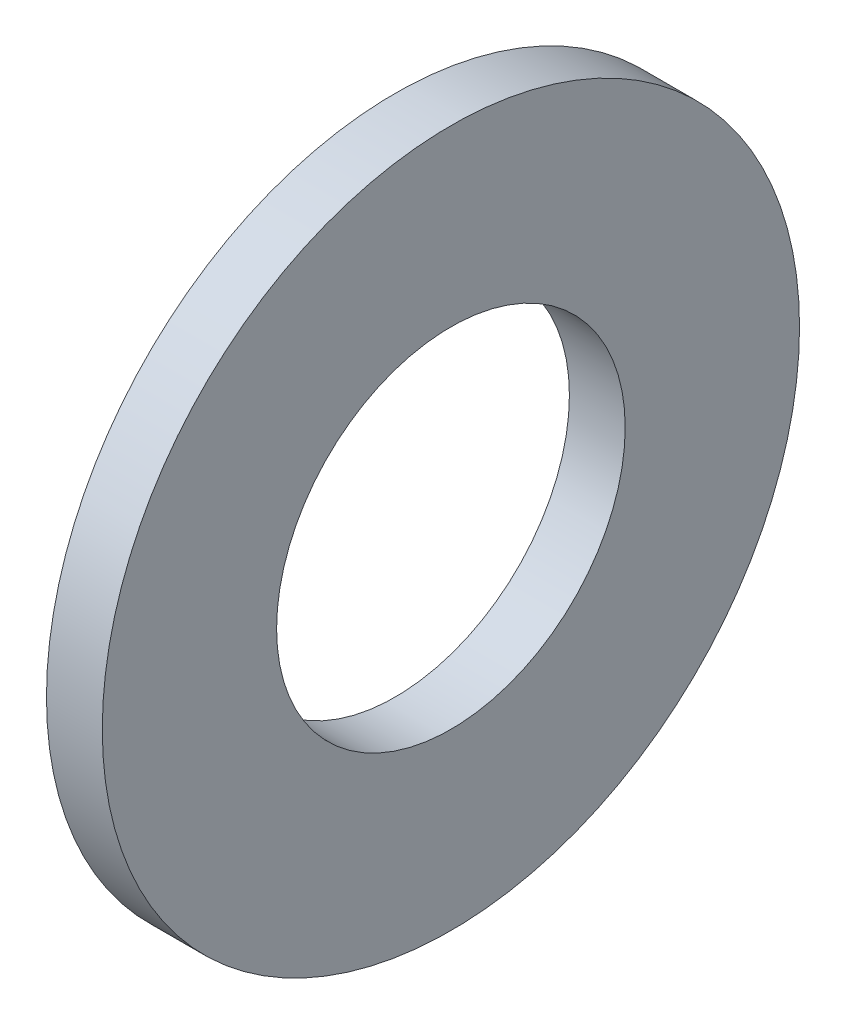
ISO-10303-21;
HEADER;
FILE_DESCRIPTION(('STEP AP214'),'2;1');
FILE_NAME('part.step','',(''),(''),'','','');
FILE_SCHEMA(('AUTOMOTIVE_DESIGN { 1 0 10303 214 1 1 1 1 }'));
ENDSEC;
DATA;
#1=APPLICATION_CONTEXT('core data for automotive mechanical design processes');
#2=APPLICATION_PROTOCOL_DEFINITION('international standard','automotive_design',2000,#1);
#3=PRODUCT_CONTEXT('',#1,'mechanical');
#4=PRODUCT('Part','Part','',(#3));
#5=PRODUCT_RELATED_PRODUCT_CATEGORY('part','',(#4));
#6=PRODUCT_DEFINITION_FORMATION('','',#4);
#7=PRODUCT_DEFINITION_CONTEXT('part definition',#1,'design');
#8=PRODUCT_DEFINITION('design','',#6,#7);
#9=PRODUCT_DEFINITION_SHAPE('','',#8);
#10=(LENGTH_UNIT() NAMED_UNIT(*) SI_UNIT(.MILLI.,.METRE.));
#11=(NAMED_UNIT(*) PLANE_ANGLE_UNIT() SI_UNIT($,.RADIAN.));
#12=(NAMED_UNIT(*) SI_UNIT($,.STERADIAN.) SOLID_ANGLE_UNIT());
#13=UNCERTAINTY_MEASURE_WITH_UNIT(LENGTH_MEASURE(1.E-05),#10,'distance_accuracy_value','');
#14=(GEOMETRIC_REPRESENTATION_CONTEXT(3) GLOBAL_UNCERTAINTY_ASSIGNED_CONTEXT((#13)) GLOBAL_UNIT_ASSIGNED_CONTEXT((#10,
#11,#12)) REPRESENTATION_CONTEXT('',''));
#15=CARTESIAN_POINT('',(0.,0.,0.));
#16=DIRECTION('',(0.,0.,1.));
#17=DIRECTION('',(1.,0.,0.));
#18=AXIS2_PLACEMENT_3D('',#15,#16,#17);
#19=CARTESIAN_POINT('',(0.0325,0.,0.));
#20=DIRECTION('',(1.,0.,0.));
#21=DIRECTION('',(0.,0.,-1.));
#22=AXIS2_PLACEMENT_3D('',#19,#20,#21);
#23=PLANE('',#22);
#24=CARTESIAN_POINT('',(0.0325,0.,0.));
#25=DIRECTION('',(1.,0.,0.));
#26=DIRECTION('',(0.,0.,-1.));
#27=AXIS2_PLACEMENT_3D('',#24,#25,#26);
#28=CIRCLE('',#27,0.406);
#29=CARTESIAN_POINT('',(0.0325,0.,-0.406));
#30=VERTEX_POINT('',#29);
#31=EDGE_CURVE('E10',#30,#30,#28,.T.);
#32=ORIENTED_EDGE('',*,*,#31,.T.);
#33=EDGE_LOOP('',(#32));
#34=FACE_BOUND('',#33,.T.);
#35=CARTESIAN_POINT('',(0.0325,0.,0.));
#36=DIRECTION('',(1.,0.,0.));
#37=DIRECTION('',(0.,0.,-1.));
#38=AXIS2_PLACEMENT_3D('',#35,#36,#37);
#39=CIRCLE('',#38,0.203);
#40=CARTESIAN_POINT('',(0.0325,0.,-0.203));
#41=VERTEX_POINT('',#40);
#42=EDGE_CURVE('E54',#41,#41,#39,.T.);
#43=ORIENTED_EDGE('',*,*,#42,.F.);
#44=EDGE_LOOP('',(#43));
#45=FACE_BOUND('',#44,.T.);
#46=ADVANCED_FACE('F41',(#34,#45),#23,.T.);
#47=CARTESIAN_POINT('',(-0.0325,0.,0.));
#48=DIRECTION('',(1.,0.,0.));
#49=DIRECTION('',(0.,0.,-1.));
#50=AXIS2_PLACEMENT_3D('',#47,#48,#49);
#51=PLANE('',#50);
#52=CARTESIAN_POINT('',(-0.0325,0.,0.));
#53=DIRECTION('',(1.,0.,0.));
#54=DIRECTION('',(0.,0.,-1.));
#55=AXIS2_PLACEMENT_3D('',#52,#53,#54);
#56=CIRCLE('',#55,0.406);
#57=CARTESIAN_POINT('',(-0.0325,0.,-0.406));
#58=VERTEX_POINT('',#57);
#59=EDGE_CURVE('E45',#58,#58,#56,.T.);
#60=ORIENTED_EDGE('',*,*,#59,.F.);
#61=EDGE_LOOP('',(#60));
#62=FACE_BOUND('',#61,.T.);
#63=CARTESIAN_POINT('',(-0.0325,0.,0.));
#64=DIRECTION('',(1.,0.,0.));
#65=DIRECTION('',(0.,0.,-1.));
#66=AXIS2_PLACEMENT_3D('',#63,#64,#65);
#67=CIRCLE('',#66,0.203);
#68=CARTESIAN_POINT('',(-0.0325,0.,-0.203));
#69=VERTEX_POINT('',#68);
#70=EDGE_CURVE('E56',#69,#69,#67,.T.);
#71=ORIENTED_EDGE('',*,*,#70,.T.);
#72=EDGE_LOOP('',(#71));
#73=FACE_BOUND('',#72,.T.);
#74=ADVANCED_FACE('F68',(#62,#73),#51,.F.);
#75=CARTESIAN_POINT('',(0.0325,0.,0.));
#76=DIRECTION('',(-1.,0.,0.));
#77=DIRECTION('',(0.,0.,1.));
#78=AXIS2_PLACEMENT_3D('',#75,#76,#77);
#79=CYLINDRICAL_SURFACE('',#78,0.406);
#80=ORIENTED_EDGE('',*,*,#31,.F.);
#81=EDGE_LOOP('',(#80));
#82=FACE_BOUND('',#81,.T.);
#83=ORIENTED_EDGE('',*,*,#59,.T.);
#84=EDGE_LOOP('',(#83));
#85=FACE_BOUND('',#84,.T.);
#86=ADVANCED_FACE('F43',(#82,#85),#79,.T.);
#87=CARTESIAN_POINT('',(0.0325,0.,0.));
#88=DIRECTION('',(-1.,0.,0.));
#89=DIRECTION('',(0.,0.,1.));
#90=AXIS2_PLACEMENT_3D('',#87,#88,#89);
#91=CYLINDRICAL_SURFACE('',#90,0.203);
#92=ORIENTED_EDGE('',*,*,#42,.T.);
#93=EDGE_LOOP('',(#92));
#94=FACE_BOUND('',#93,.T.);
#95=ORIENTED_EDGE('',*,*,#70,.F.);
#96=EDGE_LOOP('',(#95));
#97=FACE_BOUND('',#96,.T.);
#98=ADVANCED_FACE('F64',(#94,#97),#91,.F.);
#99=CLOSED_SHELL('',(#46,#74,#86,#98));
#100=MANIFOLD_SOLID_BREP('B2',#99);
#101=ADVANCED_BREP_SHAPE_REPRESENTATION('',(#18,#100),#14);
#102=SHAPE_DEFINITION_REPRESENTATION(#9,#101);
ENDSEC;
END-ISO-10303-21;
